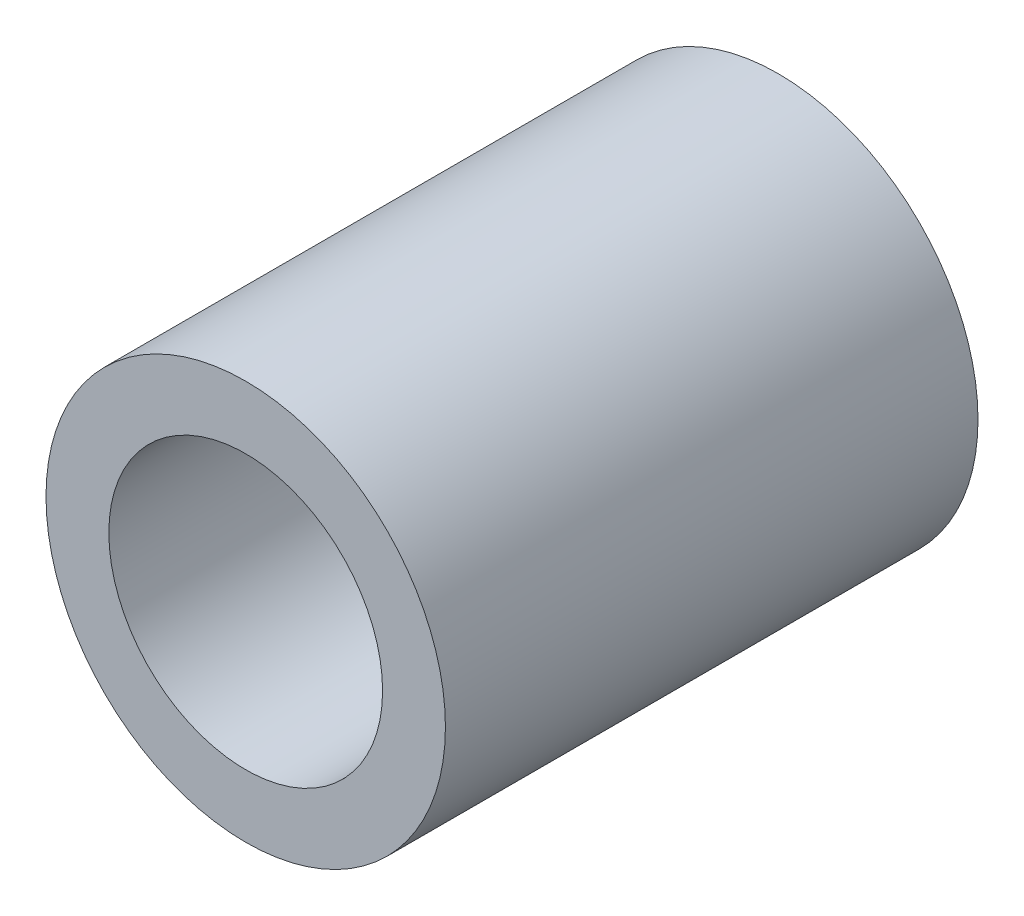
ISO-10303-21;
HEADER;
FILE_DESCRIPTION(('STEP AP214'),'2;1');
FILE_NAME('part.step','',(''),(''),'','','');
FILE_SCHEMA(('AUTOMOTIVE_DESIGN { 1 0 10303 214 1 1 1 1 }'));
ENDSEC;
DATA;
#1=APPLICATION_CONTEXT('core data for automotive mechanical design processes');
#2=APPLICATION_PROTOCOL_DEFINITION('international standard','automotive_design',2000,#1);
#3=PRODUCT_CONTEXT('',#1,'mechanical');
#4=PRODUCT('Part','Part','',(#3));
#5=PRODUCT_RELATED_PRODUCT_CATEGORY('part','',(#4));
#6=PRODUCT_DEFINITION_FORMATION('','',#4);
#7=PRODUCT_DEFINITION_CONTEXT('part definition',#1,'design');
#8=PRODUCT_DEFINITION('design','',#6,#7);
#9=PRODUCT_DEFINITION_SHAPE('','',#8);
#10=(LENGTH_UNIT() NAMED_UNIT(*) SI_UNIT(.MILLI.,.METRE.));
#11=(NAMED_UNIT(*) PLANE_ANGLE_UNIT() SI_UNIT($,.RADIAN.));
#12=(NAMED_UNIT(*) SI_UNIT($,.STERADIAN.) SOLID_ANGLE_UNIT());
#13=UNCERTAINTY_MEASURE_WITH_UNIT(LENGTH_MEASURE(1.E-05),#10,'distance_accuracy_value','');
#14=(GEOMETRIC_REPRESENTATION_CONTEXT(3) GLOBAL_UNCERTAINTY_ASSIGNED_CONTEXT((#13)) GLOBAL_UNIT_ASSIGNED_CONTEXT((#10,
#11,#12)) REPRESENTATION_CONTEXT('',''));
#15=CARTESIAN_POINT('',(0.,0.,0.));
#16=DIRECTION('',(0.,0.,1.));
#17=DIRECTION('',(1.,0.,0.));
#18=AXIS2_PLACEMENT_3D('',#15,#16,#17);
#19=CARTESIAN_POINT('',(0.,0.,3.175));
#20=DIRECTION('',(0.,0.,-1.));
#21=DIRECTION('',(-1.,0.,0.));
#22=AXIS2_PLACEMENT_3D('',#19,#20,#21);
#23=CYLINDRICAL_SURFACE('',#22,2.38125);
#24=CARTESIAN_POINT('',(0.,0.,3.175));
#25=DIRECTION('',(0.,0.,1.));
#26=DIRECTION('',(1.,0.,0.));
#27=AXIS2_PLACEMENT_3D('',#24,#25,#26);
#28=CIRCLE('',#27,2.38125);
#29=CARTESIAN_POINT('',(2.38125,0.,3.175));
#30=VERTEX_POINT('',#29);
#31=EDGE_CURVE('E10',#30,#30,#28,.T.);
#32=ORIENTED_EDGE('',*,*,#31,.F.);
#33=EDGE_LOOP('',(#32));
#34=FACE_BOUND('',#33,.T.);
#35=CARTESIAN_POINT('',(0.,0.,-3.175));
#36=DIRECTION('',(0.,0.,1.));
#37=DIRECTION('',(1.,0.,0.));
#38=AXIS2_PLACEMENT_3D('',#35,#36,#37);
#39=CIRCLE('',#38,2.38125);
#40=CARTESIAN_POINT('',(2.38125,0.,-3.175));
#41=VERTEX_POINT('',#40);
#42=EDGE_CURVE('E33',#41,#41,#39,.T.);
#43=ORIENTED_EDGE('',*,*,#42,.T.);
#44=EDGE_LOOP('',(#43));
#45=FACE_BOUND('',#44,.T.);
#46=ADVANCED_FACE('F30',(#34,#45),#23,.T.);
#47=CARTESIAN_POINT('',(0.,0.,3.175));
#48=DIRECTION('',(0.,0.,1.));
#49=DIRECTION('',(1.,0.,0.));
#50=AXIS2_PLACEMENT_3D('',#47,#48,#49);
#51=PLANE('',#50);
#52=CARTESIAN_POINT('',(0.,0.,3.175));
#53=DIRECTION('',(0.,0.,1.));
#54=DIRECTION('',(1.,0.,0.));
#55=AXIS2_PLACEMENT_3D('',#52,#53,#54);
#56=CIRCLE('',#55,1.63195);
#57=CARTESIAN_POINT('',(1.63195,0.,3.175));
#58=VERTEX_POINT('',#57);
#59=EDGE_CURVE('E44',#58,#58,#56,.T.);
#60=ORIENTED_EDGE('',*,*,#59,.F.);
#61=EDGE_LOOP('',(#60));
#62=FACE_BOUND('',#61,.T.);
#63=ORIENTED_EDGE('',*,*,#31,.T.);
#64=EDGE_LOOP('',(#63));
#65=FACE_BOUND('',#64,.T.);
#66=ADVANCED_FACE('F50',(#62,#65),#51,.T.);
#67=CARTESIAN_POINT('',(0.,0.,-3.175));
#68=DIRECTION('',(0.,0.,1.));
#69=DIRECTION('',(1.,0.,0.));
#70=AXIS2_PLACEMENT_3D('',#67,#68,#69);
#71=PLANE('',#70);
#72=CARTESIAN_POINT('',(0.,0.,-3.175));
#73=DIRECTION('',(0.,0.,1.));
#74=DIRECTION('',(1.,0.,0.));
#75=AXIS2_PLACEMENT_3D('',#72,#73,#74);
#76=CIRCLE('',#75,1.63195);
#77=CARTESIAN_POINT('',(1.63195,0.,-3.175));
#78=VERTEX_POINT('',#77);
#79=EDGE_CURVE('E40',#78,#78,#76,.T.);
#80=ORIENTED_EDGE('',*,*,#79,.T.);
#81=EDGE_LOOP('',(#80));
#82=FACE_BOUND('',#81,.T.);
#83=ORIENTED_EDGE('',*,*,#42,.F.);
#84=EDGE_LOOP('',(#83));
#85=FACE_BOUND('',#84,.T.);
#86=ADVANCED_FACE('F52',(#82,#85),#71,.F.);
#87=CARTESIAN_POINT('',(0.,0.,3.175));
#88=DIRECTION('',(0.,0.,1.));
#89=DIRECTION('',(1.,0.,0.));
#90=AXIS2_PLACEMENT_3D('',#87,#88,#89);
#91=CYLINDRICAL_SURFACE('',#90,1.63195);
#92=ORIENTED_EDGE('',*,*,#79,.F.);
#93=EDGE_LOOP('',(#92));
#94=FACE_BOUND('',#93,.T.);
#95=ORIENTED_EDGE('',*,*,#59,.T.);
#96=EDGE_LOOP('',(#95));
#97=FACE_BOUND('',#96,.T.);
#98=ADVANCED_FACE('F48',(#94,#97),#91,.F.);
#99=CLOSED_SHELL('',(#46,#66,#86,#98));
#100=MANIFOLD_SOLID_BREP('B2',#99);
#101=ADVANCED_BREP_SHAPE_REPRESENTATION('',(#18,#100),#14);
#102=SHAPE_DEFINITION_REPRESENTATION(#9,#101);
ENDSEC;
END-ISO-10303-21;
